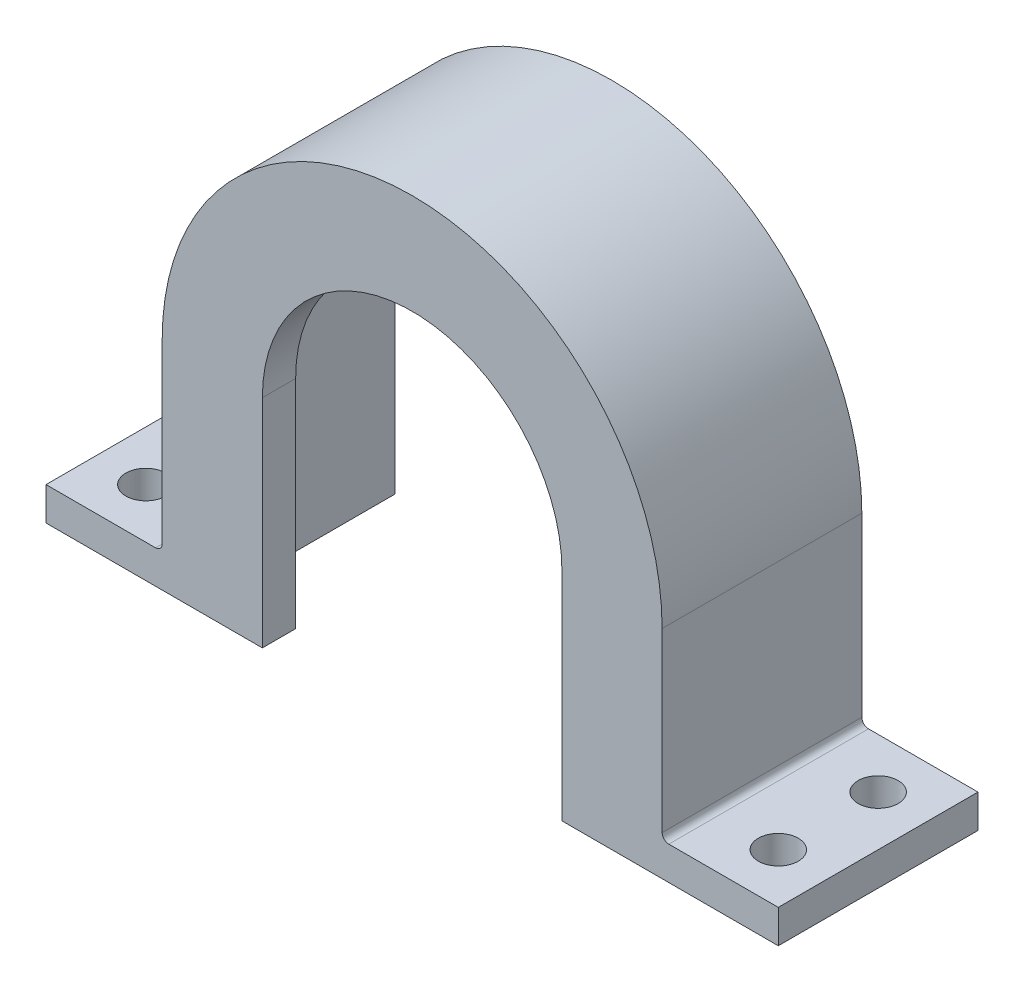
ISO-10303-21;
HEADER;
FILE_DESCRIPTION(('STEP AP214'),'2;1');
FILE_NAME('part.step','',(''),(''),'','','');
FILE_SCHEMA(('AUTOMOTIVE_DESIGN { 1 0 10303 214 1 1 1 1 }'));
ENDSEC;
DATA;
#1=APPLICATION_CONTEXT('core data for automotive mechanical design processes');
#2=APPLICATION_PROTOCOL_DEFINITION('international standard','automotive_design',2000,#1);
#3=PRODUCT_CONTEXT('',#1,'mechanical');
#4=PRODUCT('Part','Part','',(#3));
#5=PRODUCT_RELATED_PRODUCT_CATEGORY('part','',(#4));
#6=PRODUCT_DEFINITION_FORMATION('','',#4);
#7=PRODUCT_DEFINITION_CONTEXT('part definition',#1,'design');
#8=PRODUCT_DEFINITION('design','',#6,#7);
#9=PRODUCT_DEFINITION_SHAPE('','',#8);
#10=(LENGTH_UNIT() NAMED_UNIT(*) SI_UNIT(.MILLI.,.METRE.));
#11=(NAMED_UNIT(*) PLANE_ANGLE_UNIT() SI_UNIT($,.RADIAN.));
#12=(NAMED_UNIT(*) SI_UNIT($,.STERADIAN.) SOLID_ANGLE_UNIT());
#13=UNCERTAINTY_MEASURE_WITH_UNIT(LENGTH_MEASURE(1.E-05),#10,'distance_accuracy_value','');
#14=(GEOMETRIC_REPRESENTATION_CONTEXT(3) GLOBAL_UNCERTAINTY_ASSIGNED_CONTEXT((#13)) GLOBAL_UNIT_ASSIGNED_CONTEXT((#10,
#11,#12)) REPRESENTATION_CONTEXT('',''));
#15=CARTESIAN_POINT('',(0.,0.,0.));
#16=DIRECTION('',(0.,0.,1.));
#17=DIRECTION('',(1.,0.,0.));
#18=AXIS2_PLACEMENT_3D('',#15,#16,#17);
#19=CARTESIAN_POINT('',(0.,32.55,30.));
#20=DIRECTION('',(0.,0.,-1.));
#21=DIRECTION('',(-1.,0.,0.));
#22=AXIS2_PLACEMENT_3D('',#19,#20,#21);
#23=CYLINDRICAL_SURFACE('',#22,22.5);
#24=CARTESIAN_POINT('',(0.,32.55,25.));
#25=DIRECTION('',(0.,0.,-1.));
#26=DIRECTION('',(-1.,0.,0.));
#27=AXIS2_PLACEMENT_3D('',#24,#25,#26);
#28=CIRCLE('',#27,22.5);
#29=CARTESIAN_POINT('',(22.5,32.55,25.));
#30=VERTEX_POINT('',#29);
#31=CARTESIAN_POINT('',(-22.5,32.55,25.));
#32=VERTEX_POINT('',#31);
#33=EDGE_CURVE('E194',#30,#32,#28,.F.);
#34=ORIENTED_EDGE('',*,*,#33,.F.);
#35=DIRECTION('',(0.,0.,-1.));
#36=VECTOR('',#35,1.);
#37=CARTESIAN_POINT('',(22.5,32.55,30.));
#38=LINE('',#37,#36);
#39=CARTESIAN_POINT('',(22.5,32.55,30.));
#40=VERTEX_POINT('',#39);
#41=EDGE_CURVE('E208',#40,#30,#38,.T.);
#42=ORIENTED_EDGE('',*,*,#41,.F.);
#43=CARTESIAN_POINT('',(0.,32.55,30.));
#44=DIRECTION('',(0.,0.,-1.));
#45=DIRECTION('',(1.,0.,0.));
#46=AXIS2_PLACEMENT_3D('',#43,#44,#45);
#47=CIRCLE('',#46,22.5);
#48=CARTESIAN_POINT('',(-22.5,32.55,30.));
#49=VERTEX_POINT('',#48);
#50=EDGE_CURVE('E199',#49,#40,#47,.T.);
#51=ORIENTED_EDGE('',*,*,#50,.F.);
#52=DIRECTION('',(0.,0.,-1.));
#53=VECTOR('',#52,1.);
#54=CARTESIAN_POINT('',(-22.5,32.55,30.));
#55=LINE('',#54,#53);
#56=EDGE_CURVE('E209',#49,#32,#55,.T.);
#57=ORIENTED_EDGE('',*,*,#56,.T.);
#58=EDGE_LOOP('',(#34,#42,#51,#57));
#59=FACE_BOUND('',#58,.T.);
#60=ADVANCED_FACE('F34',(#59),#23,.F.);
#61=CARTESIAN_POINT('',(-22.5,0.,30.));
#62=DIRECTION('',(-1.,0.,0.));
#63=DIRECTION('',(0.,-1.,0.));
#64=AXIS2_PLACEMENT_3D('',#61,#62,#63);
#65=PLANE('',#64);
#66=DIRECTION('',(0.,-1.,0.));
#67=VECTOR('',#66,1.);
#68=CARTESIAN_POINT('',(-22.5,0.,25.));
#69=LINE('',#68,#67);
#70=CARTESIAN_POINT('',(-22.5,0.,25.));
#71=VERTEX_POINT('',#70);
#72=EDGE_CURVE('E197',#32,#71,#69,.T.);
#73=ORIENTED_EDGE('',*,*,#72,.F.);
#74=ORIENTED_EDGE('',*,*,#56,.F.);
#75=DIRECTION('',(0.,1.,0.));
#76=VECTOR('',#75,1.);
#77=CARTESIAN_POINT('',(-22.5,0.,30.));
#78=LINE('',#77,#76);
#79=CARTESIAN_POINT('',(-22.5,0.,30.));
#80=VERTEX_POINT('',#79);
#81=EDGE_CURVE('E205',#80,#49,#78,.T.);
#82=ORIENTED_EDGE('',*,*,#81,.F.);
#83=DIRECTION('',(0.,0.,-1.));
#84=VECTOR('',#83,1.);
#85=CARTESIAN_POINT('',(-22.5,0.,30.));
#86=LINE('',#85,#84);
#87=EDGE_CURVE('E213',#80,#71,#86,.T.);
#88=ORIENTED_EDGE('',*,*,#87,.T.);
#89=EDGE_LOOP('',(#73,#74,#82,#88));
#90=FACE_BOUND('',#89,.T.);
#91=ADVANCED_FACE('F383',(#90),#65,.F.);
#92=CARTESIAN_POINT('',(22.5,32.55,30.));
#93=DIRECTION('',(1.,0.,0.));
#94=DIRECTION('',(0.,0.,-1.));
#95=AXIS2_PLACEMENT_3D('',#92,#93,#94);
#96=PLANE('',#95);
#97=DIRECTION('',(0.,1.,0.));
#98=VECTOR('',#97,1.);
#99=CARTESIAN_POINT('',(22.5,32.55,25.));
#100=LINE('',#99,#98);
#101=CARTESIAN_POINT('',(22.5,0.,25.));
#102=VERTEX_POINT('',#101);
#103=EDGE_CURVE('E277',#102,#30,#100,.T.);
#104=ORIENTED_EDGE('',*,*,#103,.F.);
#105=DIRECTION('',(0.,0.,-1.));
#106=VECTOR('',#105,1.);
#107=CARTESIAN_POINT('',(22.5,0.,30.));
#108=LINE('',#107,#106);
#109=CARTESIAN_POINT('',(22.5,0.,30.));
#110=VERTEX_POINT('',#109);
#111=EDGE_CURVE('E216',#110,#102,#108,.T.);
#112=ORIENTED_EDGE('',*,*,#111,.F.);
#113=DIRECTION('',(0.,-1.,0.));
#114=VECTOR('',#113,1.);
#115=CARTESIAN_POINT('',(22.5,32.55,30.));
#116=LINE('',#115,#114);
#117=EDGE_CURVE('E202',#40,#110,#116,.T.);
#118=ORIENTED_EDGE('',*,*,#117,.F.);
#119=ORIENTED_EDGE('',*,*,#41,.T.);
#120=EDGE_LOOP('',(#104,#112,#118,#119));
#121=FACE_BOUND('',#120,.T.);
#122=ADVANCED_FACE('F372',(#121),#96,.F.);
#123=CARTESIAN_POINT('',(-55.,0.,30.));
#124=DIRECTION('',(0.,1.,0.));
#125=DIRECTION('',(-1.,0.,0.));
#126=AXIS2_PLACEMENT_3D('',#123,#124,#125);
#127=PLANE('',#126);
#128=CARTESIAN_POINT('',(-47.5,0.,22.5));
#129=DIRECTION('',(0.,-1.,0.));
#130=DIRECTION('',(1.,0.,0.));
#131=AXIS2_PLACEMENT_3D('',#128,#129,#130);
#132=CIRCLE('',#131,3.);
#133=CARTESIAN_POINT('',(-44.5,0.,22.5));
#134=VERTEX_POINT('',#133);
#135=EDGE_CURVE('E362',#134,#134,#132,.T.);
#136=ORIENTED_EDGE('',*,*,#135,.F.);
#137=EDGE_LOOP('',(#136));
#138=FACE_BOUND('',#137,.T.);
#139=CARTESIAN_POINT('',(-47.5,0.,7.5));
#140=DIRECTION('',(0.,-1.,0.));
#141=DIRECTION('',(-1.,0.,0.));
#142=AXIS2_PLACEMENT_3D('',#139,#140,#141);
#143=CIRCLE('',#142,3.);
#144=CARTESIAN_POINT('',(-50.5,0.,7.5));
#145=VERTEX_POINT('',#144);
#146=EDGE_CURVE('E350',#145,#145,#143,.T.);
#147=ORIENTED_EDGE('',*,*,#146,.F.);
#148=EDGE_LOOP('',(#147));
#149=FACE_BOUND('',#148,.T.);
#150=DIRECTION('',(1.,0.,0.));
#151=VECTOR('',#150,1.);
#152=CARTESIAN_POINT('',(-55.,0.,0.));
#153=LINE('',#152,#151);
#154=CARTESIAN_POINT('',(-55.,0.,0.));
#155=VERTEX_POINT('',#154);
#156=CARTESIAN_POINT('',(-32.55,0.,0.));
#157=VERTEX_POINT('',#156);
#158=EDGE_CURVE('E245',#155,#157,#153,.T.);
#159=ORIENTED_EDGE('',*,*,#158,.T.);
#160=DIRECTION('',(0.,0.,-1.));
#161=VECTOR('',#160,1.);
#162=CARTESIAN_POINT('',(-32.55,0.,122.065302910488));
#163=LINE('',#162,#161);
#164=CARTESIAN_POINT('',(-32.55,0.,25.));
#165=VERTEX_POINT('',#164);
#166=EDGE_CURVE('E190',#165,#157,#163,.T.);
#167=ORIENTED_EDGE('',*,*,#166,.F.);
#168=DIRECTION('',(1.,0.,0.));
#169=VECTOR('',#168,1.);
#170=CARTESIAN_POINT('',(32.55,0.,25.));
#171=LINE('',#170,#169);
#172=EDGE_CURVE('E337',#165,#71,#171,.T.);
#173=ORIENTED_EDGE('',*,*,#172,.T.);
#174=ORIENTED_EDGE('',*,*,#87,.F.);
#175=DIRECTION('',(1.,0.,0.));
#176=VECTOR('',#175,1.);
#177=CARTESIAN_POINT('',(-55.,0.,30.));
#178=LINE('',#177,#176);
#179=CARTESIAN_POINT('',(-55.,0.,30.));
#180=VERTEX_POINT('',#179);
#181=EDGE_CURVE('E226',#180,#80,#178,.T.);
#182=ORIENTED_EDGE('',*,*,#181,.F.);
#183=DIRECTION('',(0.,0.,-1.));
#184=VECTOR('',#183,1.);
#185=CARTESIAN_POINT('',(-55.,0.,30.));
#186=LINE('',#185,#184);
#187=EDGE_CURVE('E274',#180,#155,#186,.T.);
#188=ORIENTED_EDGE('',*,*,#187,.T.);
#189=EDGE_LOOP('',(#159,#167,#173,#174,#182,#188));
#190=FACE_BOUND('',#189,.T.);
#191=ADVANCED_FACE('F368',(#138,#149,#190),#127,.F.);
#192=CARTESIAN_POINT('',(-55.,0.,30.));
#193=DIRECTION('',(1.,0.,0.));
#194=DIRECTION('',(0.,0.,-1.));
#195=AXIS2_PLACEMENT_3D('',#192,#193,#194);
#196=PLANE('',#195);
#197=DIRECTION('',(0.,-1.,0.));
#198=VECTOR('',#197,1.);
#199=CARTESIAN_POINT('',(-55.,0.,0.));
#200=LINE('',#199,#198);
#201=CARTESIAN_POINT('',(-55.,5.,0.));
#202=VERTEX_POINT('',#201);
#203=EDGE_CURVE('E212',#202,#155,#200,.T.);
#204=ORIENTED_EDGE('',*,*,#203,.T.);
#205=ORIENTED_EDGE('',*,*,#187,.F.);
#206=DIRECTION('',(0.,-1.,0.));
#207=VECTOR('',#206,1.);
#208=CARTESIAN_POINT('',(-55.,0.,30.));
#209=LINE('',#208,#207);
#210=CARTESIAN_POINT('',(-55.,5.,30.));
#211=VERTEX_POINT('',#210);
#212=EDGE_CURVE('E221',#211,#180,#209,.T.);
#213=ORIENTED_EDGE('',*,*,#212,.F.);
#214=DIRECTION('',(0.,0.,-1.));
#215=VECTOR('',#214,1.);
#216=CARTESIAN_POINT('',(-55.,5.,30.));
#217=LINE('',#216,#215);
#218=EDGE_CURVE('E242',#211,#202,#217,.T.);
#219=ORIENTED_EDGE('',*,*,#218,.T.);
#220=EDGE_LOOP('',(#204,#205,#213,#219));
#221=FACE_BOUND('',#220,.T.);
#222=ADVANCED_FACE('F371',(#221),#196,.F.);
#223=CARTESIAN_POINT('',(47.5,0.,22.5));
#224=DIRECTION('',(0.,-1.,0.));
#225=DIRECTION('',(-1.,0.,0.));
#226=AXIS2_PLACEMENT_3D('',#223,#224,#225);
#227=CIRCLE('',#226,3.);
#228=CARTESIAN_POINT('',(44.5,0.,22.5));
#229=VERTEX_POINT('',#228);
#230=EDGE_CURVE('E356',#229,#229,#227,.T.);
#231=ORIENTED_EDGE('',*,*,#230,.F.);
#232=EDGE_LOOP('',(#231));
#233=FACE_BOUND('',#232,.T.);
#234=CARTESIAN_POINT('',(47.5,0.,7.5));
#235=DIRECTION('',(0.,-1.,0.));
#236=DIRECTION('',(1.,0.,0.));
#237=AXIS2_PLACEMENT_3D('',#234,#235,#236);
#238=CIRCLE('',#237,3.);
#239=CARTESIAN_POINT('',(50.5,0.,7.5));
#240=VERTEX_POINT('',#239);
#241=EDGE_CURVE('E344',#240,#240,#238,.T.);
#242=ORIENTED_EDGE('',*,*,#241,.F.);
#243=EDGE_LOOP('',(#242));
#244=FACE_BOUND('',#243,.T.);
#245=CARTESIAN_POINT('',(32.55,0.,25.));
#246=VERTEX_POINT('',#245);
#247=EDGE_CURVE('E189',#102,#246,#171,.T.);
#248=ORIENTED_EDGE('',*,*,#247,.T.);
#249=DIRECTION('',(0.,0.,-1.));
#250=VECTOR('',#249,1.);
#251=CARTESIAN_POINT('',(32.55,0.,122.065302910488));
#252=LINE('',#251,#250);
#253=CARTESIAN_POINT('',(32.55,0.,0.));
#254=VERTEX_POINT('',#253);
#255=EDGE_CURVE('E168',#246,#254,#252,.T.);
#256=ORIENTED_EDGE('',*,*,#255,.T.);
#257=CARTESIAN_POINT('',(55.,0.,0.));
#258=VERTEX_POINT('',#257);
#259=EDGE_CURVE('E183',#254,#258,#153,.T.);
#260=ORIENTED_EDGE('',*,*,#259,.T.);
#261=DIRECTION('',(0.,0.,-1.));
#262=VECTOR('',#261,1.);
#263=CARTESIAN_POINT('',(55.,0.,30.));
#264=LINE('',#263,#262);
#265=CARTESIAN_POINT('',(55.,0.,30.));
#266=VERTEX_POINT('',#265);
#267=EDGE_CURVE('E271',#266,#258,#264,.T.);
#268=ORIENTED_EDGE('',*,*,#267,.F.);
#269=EDGE_CURVE('E224',#110,#266,#178,.T.);
#270=ORIENTED_EDGE('',*,*,#269,.F.);
#271=ORIENTED_EDGE('',*,*,#111,.T.);
#272=EDGE_LOOP('',(#248,#256,#260,#268,#270,#271));
#273=FACE_BOUND('',#272,.T.);
#274=ADVANCED_FACE('F330',(#233,#244,#273),#127,.F.);
#275=CARTESIAN_POINT('',(55.,0.,30.));
#276=DIRECTION('',(-1.,0.,0.));
#277=DIRECTION('',(0.,0.,1.));
#278=AXIS2_PLACEMENT_3D('',#275,#276,#277);
#279=PLANE('',#278);
#280=DIRECTION('',(0.,1.,0.));
#281=VECTOR('',#280,1.);
#282=CARTESIAN_POINT('',(55.,0.,0.));
#283=LINE('',#282,#281);
#284=CARTESIAN_POINT('',(55.,5.00000000000001,0.));
#285=VERTEX_POINT('',#284);
#286=EDGE_CURVE('E248',#258,#285,#283,.T.);
#287=ORIENTED_EDGE('',*,*,#286,.T.);
#288=DIRECTION('',(0.,0.,-1.));
#289=VECTOR('',#288,1.);
#290=CARTESIAN_POINT('',(55.,5.00000000000001,30.));
#291=LINE('',#290,#289);
#292=CARTESIAN_POINT('',(55.,5.00000000000001,30.));
#293=VERTEX_POINT('',#292);
#294=EDGE_CURVE('E268',#293,#285,#291,.T.);
#295=ORIENTED_EDGE('',*,*,#294,.F.);
#296=DIRECTION('',(0.,1.,0.));
#297=VECTOR('',#296,1.);
#298=CARTESIAN_POINT('',(55.,0.,30.));
#299=LINE('',#298,#297);
#300=EDGE_CURVE('E229',#266,#293,#299,.T.);
#301=ORIENTED_EDGE('',*,*,#300,.F.);
#302=ORIENTED_EDGE('',*,*,#267,.T.);
#303=EDGE_LOOP('',(#287,#295,#301,#302));
#304=FACE_BOUND('',#303,.T.);
#305=ADVANCED_FACE('F325',(#304),#279,.F.);
#306=CARTESIAN_POINT('',(55.,5.00000000000001,30.));
#307=DIRECTION('',(0.,-1.,0.));
#308=DIRECTION('',(1.,0.,0.));
#309=AXIS2_PLACEMENT_3D('',#306,#307,#308);
#310=PLANE('',#309);
#311=CARTESIAN_POINT('',(47.5,5.00000000000001,22.5));
#312=DIRECTION('',(0.,-1.,0.));
#313=DIRECTION('',(1.,0.,0.));
#314=AXIS2_PLACEMENT_3D('',#311,#312,#313);
#315=CIRCLE('',#314,3.);
#316=CARTESIAN_POINT('',(50.5,5.00000000000001,22.5));
#317=VERTEX_POINT('',#316);
#318=EDGE_CURVE('E353',#317,#317,#315,.F.);
#319=ORIENTED_EDGE('',*,*,#318,.F.);
#320=EDGE_LOOP('',(#319));
#321=FACE_BOUND('',#320,.T.);
#322=CARTESIAN_POINT('',(47.5,5.00000000000001,7.5));
#323=DIRECTION('',(0.,-1.,0.));
#324=DIRECTION('',(1.,0.,0.));
#325=AXIS2_PLACEMENT_3D('',#322,#323,#324);
#326=CIRCLE('',#325,3.);
#327=CARTESIAN_POINT('',(50.5,5.00000000000001,7.5));
#328=VERTEX_POINT('',#327);
#329=EDGE_CURVE('E178',#328,#328,#326,.F.);
#330=ORIENTED_EDGE('',*,*,#329,.F.);
#331=EDGE_LOOP('',(#330));
#332=FACE_BOUND('',#331,.T.);
#333=DIRECTION('',(-1.,0.,0.));
#334=VECTOR('',#333,1.);
#335=CARTESIAN_POINT('',(55.,5.00000000000001,0.));
#336=LINE('',#335,#334);
#337=CARTESIAN_POINT('',(38.55,5.00000000000001,0.));
#338=VERTEX_POINT('',#337);
#339=EDGE_CURVE('E250',#285,#338,#336,.T.);
#340=ORIENTED_EDGE('',*,*,#339,.T.);
#341=DIRECTION('',(0.,0.,-1.));
#342=VECTOR('',#341,1.);
#343=CARTESIAN_POINT('',(38.55,5.00000000000001,30.));
#344=LINE('',#343,#342);
#345=CARTESIAN_POINT('',(38.55,5.00000000000001,30.));
#346=VERTEX_POINT('',#345);
#347=EDGE_CURVE('E49',#338,#346,#344,.F.);
#348=ORIENTED_EDGE('',*,*,#347,.T.);
#349=DIRECTION('',(-1.,0.,0.));
#350=VECTOR('',#349,1.);
#351=CARTESIAN_POINT('',(55.,5.00000000000001,30.));
#352=LINE('',#351,#350);
#353=EDGE_CURVE('E231',#293,#346,#352,.T.);
#354=ORIENTED_EDGE('',*,*,#353,.F.);
#355=ORIENTED_EDGE('',*,*,#294,.T.);
#356=EDGE_LOOP('',(#340,#348,#354,#355));
#357=FACE_BOUND('',#356,.T.);
#358=ADVANCED_FACE('F323',(#321,#332,#357),#310,.F.);
#359=CARTESIAN_POINT('',(37.55,5.00000000000001,30.));
#360=DIRECTION('',(-1.,0.,0.));
#361=DIRECTION('',(0.,-1.,0.));
#362=AXIS2_PLACEMENT_3D('',#359,#360,#361);
#363=PLANE('',#362);
#364=DIRECTION('',(0.,1.,0.));
#365=VECTOR('',#364,1.);
#366=CARTESIAN_POINT('',(37.55,5.00000000000001,30.));
#367=LINE('',#366,#365);
#368=CARTESIAN_POINT('',(37.55,6.00000000000001,30.));
#369=VERTEX_POINT('',#368);
#370=CARTESIAN_POINT('',(37.55,32.55,30.));
#371=VERTEX_POINT('',#370);
#372=EDGE_CURVE('E233',#369,#371,#367,.T.);
#373=ORIENTED_EDGE('',*,*,#372,.F.);
#374=DIRECTION('',(0.,0.,-1.));
#375=VECTOR('',#374,1.);
#376=CARTESIAN_POINT('',(37.55,6.00000000000001,0.));
#377=LINE('',#376,#375);
#378=CARTESIAN_POINT('',(37.55,6.00000000000001,0.));
#379=VERTEX_POINT('',#378);
#380=EDGE_CURVE('E284',#369,#379,#377,.T.);
#381=ORIENTED_EDGE('',*,*,#380,.T.);
#382=DIRECTION('',(0.,1.,0.));
#383=VECTOR('',#382,1.);
#384=CARTESIAN_POINT('',(37.55,5.00000000000001,0.));
#385=LINE('',#384,#383);
#386=CARTESIAN_POINT('',(37.55,32.55,0.));
#387=VERTEX_POINT('',#386);
#388=EDGE_CURVE('E252',#379,#387,#385,.T.);
#389=ORIENTED_EDGE('',*,*,#388,.T.);
#390=DIRECTION('',(0.,0.,-1.));
#391=VECTOR('',#390,1.);
#392=CARTESIAN_POINT('',(37.55,32.55,30.));
#393=LINE('',#392,#391);
#394=EDGE_CURVE('E265',#371,#387,#393,.T.);
#395=ORIENTED_EDGE('',*,*,#394,.F.);
#396=EDGE_LOOP('',(#373,#381,#389,#395));
#397=FACE_BOUND('',#396,.T.);
#398=ADVANCED_FACE('F317',(#397),#363,.F.);
#399=CARTESIAN_POINT('',(0.,32.55,30.));
#400=DIRECTION('',(0.,0.,-1.));
#401=DIRECTION('',(-1.,0.,0.));
#402=AXIS2_PLACEMENT_3D('',#399,#400,#401);
#403=CYLINDRICAL_SURFACE('',#402,37.55);
#404=CARTESIAN_POINT('',(0.,32.55,0.));
#405=DIRECTION('',(0.,0.,1.));
#406=DIRECTION('',(-1.,0.,0.));
#407=AXIS2_PLACEMENT_3D('',#404,#405,#406);
#408=CIRCLE('',#407,37.55);
#409=CARTESIAN_POINT('',(-37.55,32.55,0.));
#410=VERTEX_POINT('',#409);
#411=EDGE_CURVE('E254',#387,#410,#408,.T.);
#412=ORIENTED_EDGE('',*,*,#411,.T.);
#413=DIRECTION('',(0.,0.,-1.));
#414=VECTOR('',#413,1.);
#415=CARTESIAN_POINT('',(-37.55,32.55,30.));
#416=LINE('',#415,#414);
#417=CARTESIAN_POINT('',(-37.55,32.55,30.));
#418=VERTEX_POINT('',#417);
#419=EDGE_CURVE('E262',#418,#410,#416,.T.);
#420=ORIENTED_EDGE('',*,*,#419,.F.);
#421=CARTESIAN_POINT('',(0.,32.55,30.));
#422=DIRECTION('',(0.,0.,1.));
#423=DIRECTION('',(-1.,0.,0.));
#424=AXIS2_PLACEMENT_3D('',#421,#422,#423);
#425=CIRCLE('',#424,37.55);
#426=EDGE_CURVE('E235',#371,#418,#425,.T.);
#427=ORIENTED_EDGE('',*,*,#426,.F.);
#428=ORIENTED_EDGE('',*,*,#394,.T.);
#429=EDGE_LOOP('',(#412,#420,#427,#428));
#430=FACE_BOUND('',#429,.T.);
#431=ADVANCED_FACE('F313',(#430),#403,.T.);
#432=CARTESIAN_POINT('',(-37.55,5.,30.));
#433=DIRECTION('',(1.,0.,0.));
#434=DIRECTION('',(0.,0.,-1.));
#435=AXIS2_PLACEMENT_3D('',#432,#433,#434);
#436=PLANE('',#435);
#437=DIRECTION('',(0.,-1.,0.));
#438=VECTOR('',#437,1.);
#439=CARTESIAN_POINT('',(-37.55,5.,0.));
#440=LINE('',#439,#438);
#441=CARTESIAN_POINT('',(-37.55,6.,0.));
#442=VERTEX_POINT('',#441);
#443=EDGE_CURVE('E256',#410,#442,#440,.T.);
#444=ORIENTED_EDGE('',*,*,#443,.T.);
#445=DIRECTION('',(0.,0.,-1.));
#446=VECTOR('',#445,1.);
#447=CARTESIAN_POINT('',(-37.55,6.,30.));
#448=LINE('',#447,#446);
#449=CARTESIAN_POINT('',(-37.55,6.,30.));
#450=VERTEX_POINT('',#449);
#451=EDGE_CURVE('E282',#442,#450,#448,.F.);
#452=ORIENTED_EDGE('',*,*,#451,.T.);
#453=DIRECTION('',(0.,-1.,0.));
#454=VECTOR('',#453,1.);
#455=CARTESIAN_POINT('',(-37.55,5.,30.));
#456=LINE('',#455,#454);
#457=EDGE_CURVE('E237',#418,#450,#456,.T.);
#458=ORIENTED_EDGE('',*,*,#457,.F.);
#459=ORIENTED_EDGE('',*,*,#419,.T.);
#460=EDGE_LOOP('',(#444,#452,#458,#459));
#461=FACE_BOUND('',#460,.T.);
#462=ADVANCED_FACE('F309',(#461),#436,.F.);
#463=CARTESIAN_POINT('',(-55.,5.,30.));
#464=DIRECTION('',(0.,-1.,0.));
#465=DIRECTION('',(0.,0.,-1.));
#466=AXIS2_PLACEMENT_3D('',#463,#464,#465);
#467=PLANE('',#466);
#468=CARTESIAN_POINT('',(-47.5,4.99999999999999,22.5));
#469=DIRECTION('',(0.,-1.,0.));
#470=DIRECTION('',(1.,0.,0.));
#471=AXIS2_PLACEMENT_3D('',#468,#469,#470);
#472=CIRCLE('',#471,3.);
#473=CARTESIAN_POINT('',(-44.5,4.99999999999999,22.5));
#474=VERTEX_POINT('',#473);
#475=EDGE_CURVE('E359',#474,#474,#472,.F.);
#476=ORIENTED_EDGE('',*,*,#475,.F.);
#477=EDGE_LOOP('',(#476));
#478=FACE_BOUND('',#477,.T.);
#479=CARTESIAN_POINT('',(-47.5,4.99999999999999,7.5));
#480=DIRECTION('',(0.,-1.,0.));
#481=DIRECTION('',(1.,0.,0.));
#482=AXIS2_PLACEMENT_3D('',#479,#480,#481);
#483=CIRCLE('',#482,3.);
#484=CARTESIAN_POINT('',(-44.5,4.99999999999999,7.5));
#485=VERTEX_POINT('',#484);
#486=EDGE_CURVE('E347',#485,#485,#483,.F.);
#487=ORIENTED_EDGE('',*,*,#486,.F.);
#488=EDGE_LOOP('',(#487));
#489=FACE_BOUND('',#488,.T.);
#490=DIRECTION('',(-1.,0.,0.));
#491=VECTOR('',#490,1.);
#492=CARTESIAN_POINT('',(-55.,5.,30.));
#493=LINE('',#492,#491);
#494=CARTESIAN_POINT('',(-38.55,5.,30.));
#495=VERTEX_POINT('',#494);
#496=EDGE_CURVE('E240',#495,#211,#493,.T.);
#497=ORIENTED_EDGE('',*,*,#496,.F.);
#498=DIRECTION('',(0.,0.,-1.));
#499=VECTOR('',#498,1.);
#500=CARTESIAN_POINT('',(-38.55,5.,0.));
#501=LINE('',#500,#499);
#502=CARTESIAN_POINT('',(-38.55,5.,0.));
#503=VERTEX_POINT('',#502);
#504=EDGE_CURVE('E279',#495,#503,#501,.T.);
#505=ORIENTED_EDGE('',*,*,#504,.T.);
#506=DIRECTION('',(-1.,0.,0.));
#507=VECTOR('',#506,1.);
#508=CARTESIAN_POINT('',(-55.,5.,0.));
#509=LINE('',#508,#507);
#510=EDGE_CURVE('E225',#503,#202,#509,.T.);
#511=ORIENTED_EDGE('',*,*,#510,.T.);
#512=ORIENTED_EDGE('',*,*,#218,.F.);
#513=EDGE_LOOP('',(#497,#505,#511,#512));
#514=FACE_BOUND('',#513,.T.);
#515=ADVANCED_FACE('F301',(#478,#489,#514),#467,.F.);
#516=CARTESIAN_POINT('',(0.,32.55,30.));
#517=DIRECTION('',(0.,0.,-1.));
#518=DIRECTION('',(-1.,0.,0.));
#519=AXIS2_PLACEMENT_3D('',#516,#517,#518);
#520=PLANE('',#519);
#521=ORIENTED_EDGE('',*,*,#181,.T.);
#522=ORIENTED_EDGE('',*,*,#81,.T.);
#523=ORIENTED_EDGE('',*,*,#50,.T.);
#524=ORIENTED_EDGE('',*,*,#117,.T.);
#525=ORIENTED_EDGE('',*,*,#269,.T.);
#526=ORIENTED_EDGE('',*,*,#300,.T.);
#527=ORIENTED_EDGE('',*,*,#353,.T.);
#528=CARTESIAN_POINT('',(38.55,6.00000000000001,30.));
#529=DIRECTION('',(0.,0.,-1.));
#530=DIRECTION('',(-1.,0.,0.));
#531=AXIS2_PLACEMENT_3D('',#528,#529,#530);
#532=CIRCLE('',#531,1.);
#533=EDGE_CURVE('E12',#346,#369,#532,.T.);
#534=ORIENTED_EDGE('',*,*,#533,.T.);
#535=ORIENTED_EDGE('',*,*,#372,.T.);
#536=ORIENTED_EDGE('',*,*,#426,.T.);
#537=ORIENTED_EDGE('',*,*,#457,.T.);
#538=CARTESIAN_POINT('',(-38.55,6.,30.));
#539=DIRECTION('',(0.,0.,-1.));
#540=DIRECTION('',(-1.,0.,0.));
#541=AXIS2_PLACEMENT_3D('',#538,#539,#540);
#542=CIRCLE('',#541,1.);
#543=EDGE_CURVE('E290',#450,#495,#542,.T.);
#544=ORIENTED_EDGE('',*,*,#543,.T.);
#545=ORIENTED_EDGE('',*,*,#496,.T.);
#546=ORIENTED_EDGE('',*,*,#212,.T.);
#547=EDGE_LOOP('',(#521,#522,#523,#524,#525,#526,#527,#534,#535,#536,#537,#544,#545,#546));
#548=FACE_BOUND('',#547,.T.);
#549=ADVANCED_FACE('F294',(#548),#520,.F.);
#550=CARTESIAN_POINT('',(0.,32.55,0.));
#551=DIRECTION('',(0.,0.,-1.));
#552=DIRECTION('',(-1.,0.,0.));
#553=AXIS2_PLACEMENT_3D('',#550,#551,#552);
#554=PLANE('',#553);
#555=DIRECTION('',(0.,1.,0.));
#556=VECTOR('',#555,1.);
#557=CARTESIAN_POINT('',(-32.55,0.,0.));
#558=LINE('',#557,#556);
#559=CARTESIAN_POINT('',(-32.55,32.55,0.));
#560=VERTEX_POINT('',#559);
#561=EDGE_CURVE('E169',#157,#560,#558,.T.);
#562=ORIENTED_EDGE('',*,*,#561,.F.);
#563=ORIENTED_EDGE('',*,*,#158,.F.);
#564=ORIENTED_EDGE('',*,*,#203,.F.);
#565=ORIENTED_EDGE('',*,*,#510,.F.);
#566=CARTESIAN_POINT('',(-38.55,6.,0.));
#567=DIRECTION('',(0.,0.,-1.));
#568=DIRECTION('',(-1.,0.,0.));
#569=AXIS2_PLACEMENT_3D('',#566,#567,#568);
#570=CIRCLE('',#569,1.);
#571=EDGE_CURVE('E288',#503,#442,#570,.F.);
#572=ORIENTED_EDGE('',*,*,#571,.T.);
#573=ORIENTED_EDGE('',*,*,#443,.F.);
#574=ORIENTED_EDGE('',*,*,#411,.F.);
#575=ORIENTED_EDGE('',*,*,#388,.F.);
#576=CARTESIAN_POINT('',(38.55,6.00000000000001,0.));
#577=DIRECTION('',(0.,0.,-1.));
#578=DIRECTION('',(-1.,0.,0.));
#579=AXIS2_PLACEMENT_3D('',#576,#577,#578);
#580=CIRCLE('',#579,1.);
#581=EDGE_CURVE('E42',#379,#338,#580,.F.);
#582=ORIENTED_EDGE('',*,*,#581,.T.);
#583=ORIENTED_EDGE('',*,*,#339,.F.);
#584=ORIENTED_EDGE('',*,*,#286,.F.);
#585=ORIENTED_EDGE('',*,*,#259,.F.);
#586=DIRECTION('',(0.,-1.,0.));
#587=VECTOR('',#586,1.);
#588=CARTESIAN_POINT('',(32.55,32.55,0.));
#589=LINE('',#588,#587);
#590=CARTESIAN_POINT('',(32.55,32.55,0.));
#591=VERTEX_POINT('',#590);
#592=EDGE_CURVE('E162',#591,#254,#589,.T.);
#593=ORIENTED_EDGE('',*,*,#592,.F.);
#594=CARTESIAN_POINT('',(0.,32.55,0.));
#595=DIRECTION('',(0.,0.,-1.));
#596=DIRECTION('',(1.,0.,0.));
#597=AXIS2_PLACEMENT_3D('',#594,#595,#596);
#598=CIRCLE('',#597,32.55);
#599=EDGE_CURVE('E172',#560,#591,#598,.T.);
#600=ORIENTED_EDGE('',*,*,#599,.F.);
#601=EDGE_LOOP('',(#562,#563,#564,#565,#572,#573,#574,#575,#582,#583,#584,#585,#593,#600));
#602=FACE_BOUND('',#601,.T.);
#603=ADVANCED_FACE('F181',(#602),#554,.T.);
#604=CARTESIAN_POINT('',(0.,32.55,25.));
#605=DIRECTION('',(0.,0.,-1.));
#606=DIRECTION('',(-1.,0.,0.));
#607=AXIS2_PLACEMENT_3D('',#604,#605,#606);
#608=PLANE('',#607);
#609=ORIENTED_EDGE('',*,*,#72,.T.);
#610=ORIENTED_EDGE('',*,*,#172,.F.);
#611=DIRECTION('',(0.,-1.,0.));
#612=VECTOR('',#611,1.);
#613=CARTESIAN_POINT('',(-32.55,0.,25.));
#614=LINE('',#613,#612);
#615=CARTESIAN_POINT('',(-32.55,32.55,25.));
#616=VERTEX_POINT('',#615);
#617=EDGE_CURVE('E336',#616,#165,#614,.T.);
#618=ORIENTED_EDGE('',*,*,#617,.F.);
#619=CARTESIAN_POINT('',(0.,32.55,25.));
#620=DIRECTION('',(0.,0.,-1.));
#621=DIRECTION('',(-1.,0.,0.));
#622=AXIS2_PLACEMENT_3D('',#619,#620,#621);
#623=CIRCLE('',#622,32.55);
#624=CARTESIAN_POINT('',(32.55,32.55,25.));
#625=VERTEX_POINT('',#624);
#626=EDGE_CURVE('E195',#625,#616,#623,.F.);
#627=ORIENTED_EDGE('',*,*,#626,.F.);
#628=DIRECTION('',(0.,1.,0.));
#629=VECTOR('',#628,1.);
#630=CARTESIAN_POINT('',(32.55,32.55,25.));
#631=LINE('',#630,#629);
#632=EDGE_CURVE('E165',#246,#625,#631,.T.);
#633=ORIENTED_EDGE('',*,*,#632,.F.);
#634=ORIENTED_EDGE('',*,*,#247,.F.);
#635=ORIENTED_EDGE('',*,*,#103,.T.);
#636=ORIENTED_EDGE('',*,*,#33,.T.);
#637=EDGE_LOOP('',(#609,#610,#618,#627,#633,#634,#635,#636));
#638=FACE_BOUND('',#637,.T.);
#639=ADVANCED_FACE('F332',(#638),#608,.T.);
#640=CARTESIAN_POINT('',(0.,32.55,122.065302910488));
#641=DIRECTION('',(0.,0.,-1.));
#642=DIRECTION('',(-1.,0.,0.));
#643=AXIS2_PLACEMENT_3D('',#640,#641,#642);
#644=CYLINDRICAL_SURFACE('',#643,32.55);
#645=ORIENTED_EDGE('',*,*,#626,.T.);
#646=DIRECTION('',(0.,0.,-1.));
#647=VECTOR('',#646,1.);
#648=CARTESIAN_POINT('',(-32.55,32.55,122.065302910488));
#649=LINE('',#648,#647);
#650=EDGE_CURVE('E175',#616,#560,#649,.T.);
#651=ORIENTED_EDGE('',*,*,#650,.T.);
#652=ORIENTED_EDGE('',*,*,#599,.T.);
#653=DIRECTION('',(0.,0.,-1.));
#654=VECTOR('',#653,1.);
#655=CARTESIAN_POINT('',(32.55,32.55,122.065302910488));
#656=LINE('',#655,#654);
#657=EDGE_CURVE('E158',#625,#591,#656,.T.);
#658=ORIENTED_EDGE('',*,*,#657,.F.);
#659=EDGE_LOOP('',(#645,#651,#652,#658));
#660=FACE_BOUND('',#659,.T.);
#661=ADVANCED_FACE('F173',(#660),#644,.F.);
#662=CARTESIAN_POINT('',(-32.55,0.,122.065302910488));
#663=DIRECTION('',(-1.,0.,0.));
#664=DIRECTION('',(0.,0.,1.));
#665=AXIS2_PLACEMENT_3D('',#662,#663,#664);
#666=PLANE('',#665);
#667=ORIENTED_EDGE('',*,*,#617,.T.);
#668=ORIENTED_EDGE('',*,*,#166,.T.);
#669=ORIENTED_EDGE('',*,*,#561,.T.);
#670=ORIENTED_EDGE('',*,*,#650,.F.);
#671=EDGE_LOOP('',(#667,#668,#669,#670));
#672=FACE_BOUND('',#671,.T.);
#673=ADVANCED_FACE('F379',(#672),#666,.F.);
#674=CARTESIAN_POINT('',(32.55,32.55,122.065302910488));
#675=DIRECTION('',(1.,0.,0.));
#676=DIRECTION('',(0.,1.,0.));
#677=AXIS2_PLACEMENT_3D('',#674,#675,#676);
#678=PLANE('',#677);
#679=ORIENTED_EDGE('',*,*,#632,.T.);
#680=ORIENTED_EDGE('',*,*,#657,.T.);
#681=ORIENTED_EDGE('',*,*,#592,.T.);
#682=ORIENTED_EDGE('',*,*,#255,.F.);
#683=EDGE_LOOP('',(#679,#680,#681,#682));
#684=FACE_BOUND('',#683,.T.);
#685=ADVANCED_FACE('F160',(#684),#678,.F.);
#686=CARTESIAN_POINT('',(47.5,13.4852813742386,7.5));
#687=DIRECTION('',(0.,-1.,0.));
#688=DIRECTION('',(1.,0.,0.));
#689=AXIS2_PLACEMENT_3D('',#686,#687,#688);
#690=CYLINDRICAL_SURFACE('',#689,3.);
#691=ORIENTED_EDGE('',*,*,#329,.T.);
#692=EDGE_LOOP('',(#691));
#693=FACE_BOUND('',#692,.T.);
#694=ORIENTED_EDGE('',*,*,#241,.T.);
#695=EDGE_LOOP('',(#694));
#696=FACE_BOUND('',#695,.T.);
#697=ADVANCED_FACE('F478',(#693,#696),#690,.F.);
#698=CARTESIAN_POINT('',(-47.5,13.4852813742386,7.5));
#699=DIRECTION('',(0.,-1.,0.));
#700=DIRECTION('',(1.,0.,0.));
#701=AXIS2_PLACEMENT_3D('',#698,#699,#700);
#702=CYLINDRICAL_SURFACE('',#701,3.);
#703=ORIENTED_EDGE('',*,*,#486,.T.);
#704=EDGE_LOOP('',(#703));
#705=FACE_BOUND('',#704,.T.);
#706=ORIENTED_EDGE('',*,*,#146,.T.);
#707=EDGE_LOOP('',(#706));
#708=FACE_BOUND('',#707,.T.);
#709=ADVANCED_FACE('F486',(#705,#708),#702,.F.);
#710=CARTESIAN_POINT('',(47.5,13.4852813742386,22.5));
#711=DIRECTION('',(0.,-1.,0.));
#712=DIRECTION('',(1.,0.,0.));
#713=AXIS2_PLACEMENT_3D('',#710,#711,#712);
#714=CYLINDRICAL_SURFACE('',#713,3.);
#715=ORIENTED_EDGE('',*,*,#318,.T.);
#716=EDGE_LOOP('',(#715));
#717=FACE_BOUND('',#716,.T.);
#718=ORIENTED_EDGE('',*,*,#230,.T.);
#719=EDGE_LOOP('',(#718));
#720=FACE_BOUND('',#719,.T.);
#721=ADVANCED_FACE('F494',(#717,#720),#714,.F.);
#722=CARTESIAN_POINT('',(-47.5,13.4852813742386,22.5));
#723=DIRECTION('',(0.,-1.,0.));
#724=DIRECTION('',(1.,0.,0.));
#725=AXIS2_PLACEMENT_3D('',#722,#723,#724);
#726=CYLINDRICAL_SURFACE('',#725,3.);
#727=ORIENTED_EDGE('',*,*,#475,.T.);
#728=EDGE_LOOP('',(#727));
#729=FACE_BOUND('',#728,.T.);
#730=ORIENTED_EDGE('',*,*,#135,.T.);
#731=EDGE_LOOP('',(#730));
#732=FACE_BOUND('',#731,.T.);
#733=ADVANCED_FACE('F366',(#729,#732),#726,.F.);
#734=CARTESIAN_POINT('',(-38.55,6.,30.));
#735=DIRECTION('',(0.,0.,1.));
#736=DIRECTION('',(1.,0.,0.));
#737=AXIS2_PLACEMENT_3D('',#734,#735,#736);
#738=CYLINDRICAL_SURFACE('',#737,1.);
#739=ORIENTED_EDGE('',*,*,#543,.F.);
#740=ORIENTED_EDGE('',*,*,#451,.F.);
#741=ORIENTED_EDGE('',*,*,#571,.F.);
#742=ORIENTED_EDGE('',*,*,#504,.F.);
#743=EDGE_LOOP('',(#739,#740,#741,#742));
#744=FACE_BOUND('',#743,.T.);
#745=ADVANCED_FACE('F304',(#744),#738,.F.);
#746=CARTESIAN_POINT('',(38.55,6.00000000000001,30.));
#747=DIRECTION('',(0.,0.,1.));
#748=DIRECTION('',(1.,0.,0.));
#749=AXIS2_PLACEMENT_3D('',#746,#747,#748);
#750=CYLINDRICAL_SURFACE('',#749,1.);
#751=ORIENTED_EDGE('',*,*,#533,.F.);
#752=ORIENTED_EDGE('',*,*,#347,.F.);
#753=ORIENTED_EDGE('',*,*,#581,.F.);
#754=ORIENTED_EDGE('',*,*,#380,.F.);
#755=EDGE_LOOP('',(#751,#752,#753,#754));
#756=FACE_BOUND('',#755,.T.);
#757=ADVANCED_FACE('F36',(#756),#750,.F.);
#758=CLOSED_SHELL('',(#60,#91,#122,#191,#222,#274,#305,#358,#398,#431,#462,#515,#549,#603,#639,
#661,#673,#685,#697,#709,#721,#733,#745,#757));
#759=MANIFOLD_SOLID_BREP('B2',#758);
#760=ADVANCED_BREP_SHAPE_REPRESENTATION('',(#18,#759),#14);
#761=SHAPE_DEFINITION_REPRESENTATION(#9,#760);
ENDSEC;
END-ISO-10303-21;
